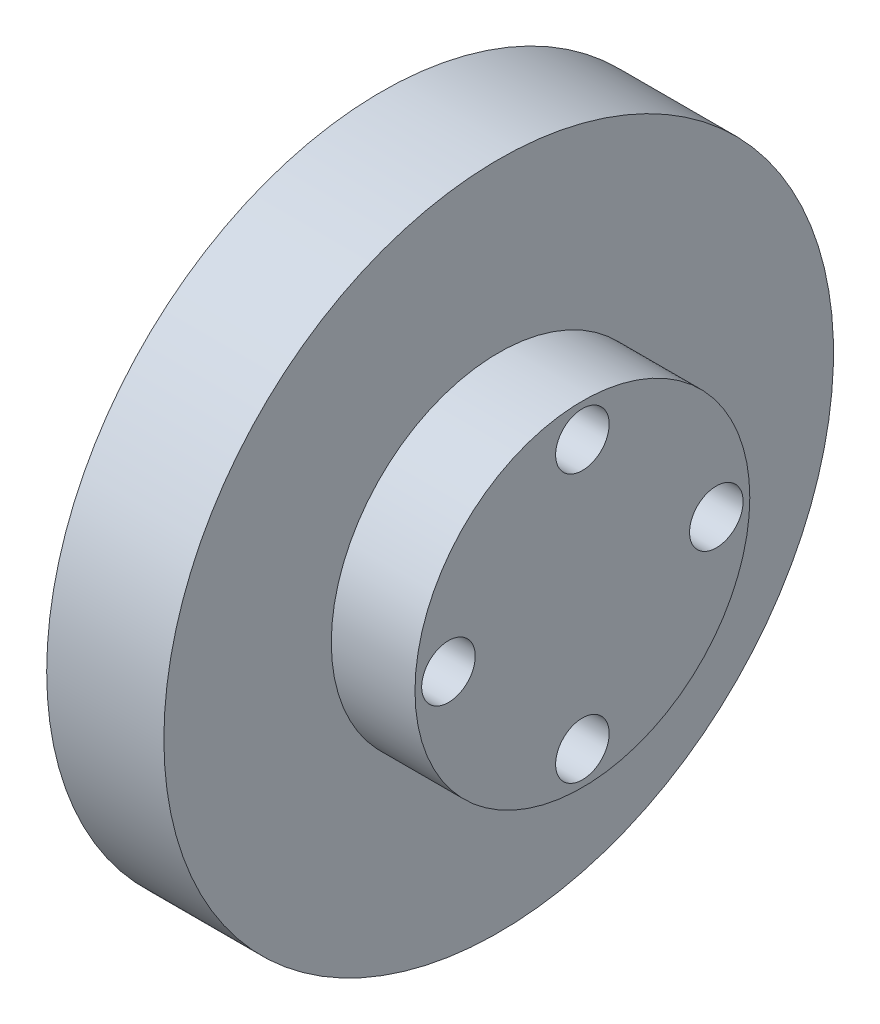
ISO-10303-21;
HEADER;
FILE_DESCRIPTION(('STEP AP214'),'2;1');
FILE_NAME('part.step','',(''),(''),'','','');
FILE_SCHEMA(('AUTOMOTIVE_DESIGN { 1 0 10303 214 1 1 1 1 }'));
ENDSEC;
DATA;
#1=APPLICATION_CONTEXT('core data for automotive mechanical design processes');
#2=APPLICATION_PROTOCOL_DEFINITION('international standard','automotive_design',2000,#1);
#3=PRODUCT_CONTEXT('',#1,'mechanical');
#4=PRODUCT('Part','Part','',(#3));
#5=PRODUCT_RELATED_PRODUCT_CATEGORY('part','',(#4));
#6=PRODUCT_DEFINITION_FORMATION('','',#4);
#7=PRODUCT_DEFINITION_CONTEXT('part definition',#1,'design');
#8=PRODUCT_DEFINITION('design','',#6,#7);
#9=PRODUCT_DEFINITION_SHAPE('','',#8);
#10=(LENGTH_UNIT() NAMED_UNIT(*) SI_UNIT(.MILLI.,.METRE.));
#11=(NAMED_UNIT(*) PLANE_ANGLE_UNIT() SI_UNIT($,.RADIAN.));
#12=(NAMED_UNIT(*) SI_UNIT($,.STERADIAN.) SOLID_ANGLE_UNIT());
#13=UNCERTAINTY_MEASURE_WITH_UNIT(LENGTH_MEASURE(1.E-05),#10,'distance_accuracy_value','');
#14=(GEOMETRIC_REPRESENTATION_CONTEXT(3) GLOBAL_UNCERTAINTY_ASSIGNED_CONTEXT((#13)) GLOBAL_UNIT_ASSIGNED_CONTEXT((#10,
#11,#12)) REPRESENTATION_CONTEXT('',''));
#15=CARTESIAN_POINT('',(0.,0.,0.));
#16=DIRECTION('',(0.,0.,1.));
#17=DIRECTION('',(1.,0.,0.));
#18=AXIS2_PLACEMENT_3D('',#15,#16,#17);
#19=CARTESIAN_POINT('',(10.,2.,0.));
#20=DIRECTION('',(1.,0.,0.));
#21=DIRECTION('',(0.,0.,-1.));
#22=AXIS2_PLACEMENT_3D('',#19,#20,#21);
#23=PLANE('',#22);
#24=CARTESIAN_POINT('',(10.,8.,0.));
#25=DIRECTION('',(1.,0.,0.));
#26=DIRECTION('',(0.,0.,-1.));
#27=AXIS2_PLACEMENT_3D('',#24,#25,#26);
#28=CIRCLE('',#27,1.6);
#29=CARTESIAN_POINT('',(10.,8.,-1.6));
#30=VERTEX_POINT('',#29);
#31=EDGE_CURVE('E55',#30,#30,#28,.T.);
#32=ORIENTED_EDGE('',*,*,#31,.T.);
#33=EDGE_LOOP('',(#32));
#34=FACE_BOUND('',#33,.T.);
#35=CARTESIAN_POINT('',(10.,0.,-8.));
#36=DIRECTION('',(1.,0.,0.));
#37=DIRECTION('',(0.,0.,-1.));
#38=AXIS2_PLACEMENT_3D('',#35,#36,#37);
#39=CIRCLE('',#38,1.6);
#40=CARTESIAN_POINT('',(10.,0.,-9.6));
#41=VERTEX_POINT('',#40);
#42=EDGE_CURVE('E58',#41,#41,#39,.T.);
#43=ORIENTED_EDGE('',*,*,#42,.T.);
#44=EDGE_LOOP('',(#43));
#45=FACE_BOUND('',#44,.T.);
#46=CARTESIAN_POINT('',(10.,-8.,0.));
#47=DIRECTION('',(1.,0.,0.));
#48=DIRECTION('',(0.,0.,-1.));
#49=AXIS2_PLACEMENT_3D('',#46,#47,#48);
#50=CIRCLE('',#49,1.6);
#51=CARTESIAN_POINT('',(10.,-8.,-1.6));
#52=VERTEX_POINT('',#51);
#53=EDGE_CURVE('E61',#52,#52,#50,.T.);
#54=ORIENTED_EDGE('',*,*,#53,.T.);
#55=EDGE_LOOP('',(#54));
#56=FACE_BOUND('',#55,.T.);
#57=CARTESIAN_POINT('',(10.,0.,8.));
#58=DIRECTION('',(1.,0.,0.));
#59=DIRECTION('',(0.,0.,-1.));
#60=AXIS2_PLACEMENT_3D('',#57,#58,#59);
#61=CIRCLE('',#60,1.6);
#62=CARTESIAN_POINT('',(10.,0.,6.4));
#63=VERTEX_POINT('',#62);
#64=EDGE_CURVE('E64',#63,#63,#61,.T.);
#65=ORIENTED_EDGE('',*,*,#64,.T.);
#66=EDGE_LOOP('',(#65));
#67=FACE_BOUND('',#66,.T.);
#68=CARTESIAN_POINT('',(10.,0.,0.));
#69=DIRECTION('',(-1.,0.,0.));
#70=DIRECTION('',(0.,0.,1.));
#71=AXIS2_PLACEMENT_3D('',#68,#69,#70);
#72=CIRCLE('',#71,20.);
#73=CARTESIAN_POINT('',(10.,0.,20.));
#74=VERTEX_POINT('',#73);
#75=EDGE_CURVE('E10',#74,#74,#72,.T.);
#76=ORIENTED_EDGE('',*,*,#75,.T.);
#77=EDGE_LOOP('',(#76));
#78=FACE_BOUND('',#77,.T.);
#79=ADVANCED_FACE('F36',(#34,#45,#56,#67,#78),#23,.F.);
#80=CARTESIAN_POINT('',(0.,0.,0.));
#81=DIRECTION('',(-1.,0.,0.));
#82=DIRECTION('',(0.,0.,1.));
#83=AXIS2_PLACEMENT_3D('',#80,#81,#82);
#84=CYLINDRICAL_SURFACE('',#83,20.);
#85=ORIENTED_EDGE('',*,*,#75,.F.);
#86=EDGE_LOOP('',(#85));
#87=FACE_BOUND('',#86,.T.);
#88=CARTESIAN_POINT('',(17.,0.,0.));
#89=DIRECTION('',(-1.,0.,0.));
#90=DIRECTION('',(0.,0.,1.));
#91=AXIS2_PLACEMENT_3D('',#88,#89,#90);
#92=CIRCLE('',#91,20.);
#93=CARTESIAN_POINT('',(17.,0.,20.));
#94=VERTEX_POINT('',#93);
#95=EDGE_CURVE('E42',#94,#94,#92,.T.);
#96=ORIENTED_EDGE('',*,*,#95,.T.);
#97=EDGE_LOOP('',(#96));
#98=FACE_BOUND('',#97,.T.);
#99=ADVANCED_FACE('F105',(#87,#98),#84,.T.);
#100=CARTESIAN_POINT('',(17.,20.,0.));
#101=DIRECTION('',(-1.,0.,0.));
#102=DIRECTION('',(0.,0.,1.));
#103=AXIS2_PLACEMENT_3D('',#100,#101,#102);
#104=PLANE('',#103);
#105=ORIENTED_EDGE('',*,*,#95,.F.);
#106=EDGE_LOOP('',(#105));
#107=FACE_BOUND('',#106,.T.);
#108=CARTESIAN_POINT('',(17.,0.,0.));
#109=DIRECTION('',(-1.,0.,0.));
#110=DIRECTION('',(0.,0.,1.));
#111=AXIS2_PLACEMENT_3D('',#108,#109,#110);
#112=CIRCLE('',#111,10.);
#113=CARTESIAN_POINT('',(17.,0.,10.));
#114=VERTEX_POINT('',#113);
#115=EDGE_CURVE('E46',#114,#114,#112,.T.);
#116=ORIENTED_EDGE('',*,*,#115,.T.);
#117=EDGE_LOOP('',(#116));
#118=FACE_BOUND('',#117,.T.);
#119=ADVANCED_FACE('F98',(#107,#118),#104,.F.);
#120=CARTESIAN_POINT('',(0.,0.,0.));
#121=DIRECTION('',(-1.,0.,0.));
#122=DIRECTION('',(0.,0.,1.));
#123=AXIS2_PLACEMENT_3D('',#120,#121,#122);
#124=CYLINDRICAL_SURFACE('',#123,10.);
#125=ORIENTED_EDGE('',*,*,#115,.F.);
#126=EDGE_LOOP('',(#125));
#127=FACE_BOUND('',#126,.T.);
#128=CARTESIAN_POINT('',(22.,0.,0.));
#129=DIRECTION('',(-1.,0.,0.));
#130=DIRECTION('',(0.,0.,1.));
#131=AXIS2_PLACEMENT_3D('',#128,#129,#130);
#132=CIRCLE('',#131,10.);
#133=CARTESIAN_POINT('',(22.,0.,10.));
#134=VERTEX_POINT('',#133);
#135=EDGE_CURVE('E50',#134,#134,#132,.T.);
#136=ORIENTED_EDGE('',*,*,#135,.T.);
#137=EDGE_LOOP('',(#136));
#138=FACE_BOUND('',#137,.T.);
#139=ADVANCED_FACE('F87',(#127,#138),#124,.T.);
#140=CARTESIAN_POINT('',(22.,10.,0.));
#141=DIRECTION('',(-1.,0.,0.));
#142=DIRECTION('',(0.,0.,1.));
#143=AXIS2_PLACEMENT_3D('',#140,#141,#142);
#144=PLANE('',#143);
#145=CARTESIAN_POINT('',(22.,8.,0.));
#146=DIRECTION('',(1.,0.,0.));
#147=DIRECTION('',(0.,0.,-1.));
#148=AXIS2_PLACEMENT_3D('',#145,#146,#147);
#149=CIRCLE('',#148,1.6);
#150=CARTESIAN_POINT('',(22.,8.,-1.6));
#151=VERTEX_POINT('',#150);
#152=EDGE_CURVE('E67',#151,#151,#149,.T.);
#153=ORIENTED_EDGE('',*,*,#152,.F.);
#154=EDGE_LOOP('',(#153));
#155=FACE_BOUND('',#154,.T.);
#156=CARTESIAN_POINT('',(22.,0.,-8.));
#157=DIRECTION('',(1.,0.,0.));
#158=DIRECTION('',(0.,0.,-1.));
#159=AXIS2_PLACEMENT_3D('',#156,#157,#158);
#160=CIRCLE('',#159,1.6);
#161=CARTESIAN_POINT('',(22.,0.,-9.6));
#162=VERTEX_POINT('',#161);
#163=EDGE_CURVE('E74',#162,#162,#160,.T.);
#164=ORIENTED_EDGE('',*,*,#163,.F.);
#165=EDGE_LOOP('',(#164));
#166=FACE_BOUND('',#165,.T.);
#167=CARTESIAN_POINT('',(22.,-8.,0.));
#168=DIRECTION('',(1.,0.,0.));
#169=DIRECTION('',(0.,0.,-1.));
#170=AXIS2_PLACEMENT_3D('',#167,#168,#169);
#171=CIRCLE('',#170,1.6);
#172=CARTESIAN_POINT('',(22.,-8.,-1.6));
#173=VERTEX_POINT('',#172);
#174=EDGE_CURVE('E71',#173,#173,#171,.T.);
#175=ORIENTED_EDGE('',*,*,#174,.F.);
#176=EDGE_LOOP('',(#175));
#177=FACE_BOUND('',#176,.T.);
#178=CARTESIAN_POINT('',(22.,0.,8.));
#179=DIRECTION('',(1.,0.,0.));
#180=DIRECTION('',(0.,0.,-1.));
#181=AXIS2_PLACEMENT_3D('',#178,#179,#180);
#182=CIRCLE('',#181,1.6);
#183=CARTESIAN_POINT('',(22.,0.,6.4));
#184=VERTEX_POINT('',#183);
#185=EDGE_CURVE('E68',#184,#184,#182,.T.);
#186=ORIENTED_EDGE('',*,*,#185,.F.);
#187=EDGE_LOOP('',(#186));
#188=FACE_BOUND('',#187,.T.);
#189=ORIENTED_EDGE('',*,*,#135,.F.);
#190=EDGE_LOOP('',(#189));
#191=FACE_BOUND('',#190,.T.);
#192=ADVANCED_FACE('F83',(#155,#166,#177,#188,#191),#144,.F.);
#193=CARTESIAN_POINT('',(-1.,0.,8.));
#194=DIRECTION('',(1.,0.,0.));
#195=DIRECTION('',(0.,0.,-1.));
#196=AXIS2_PLACEMENT_3D('',#193,#194,#195);
#197=CYLINDRICAL_SURFACE('',#196,1.6);
#198=ORIENTED_EDGE('',*,*,#185,.T.);
#199=EDGE_LOOP('',(#198));
#200=FACE_BOUND('',#199,.T.);
#201=ORIENTED_EDGE('',*,*,#64,.F.);
#202=EDGE_LOOP('',(#201));
#203=FACE_BOUND('',#202,.T.);
#204=ADVANCED_FACE('F86',(#200,#203),#197,.F.);
#205=CARTESIAN_POINT('',(-1.,-8.,0.));
#206=DIRECTION('',(1.,0.,0.));
#207=DIRECTION('',(0.,0.,-1.));
#208=AXIS2_PLACEMENT_3D('',#205,#206,#207);
#209=CYLINDRICAL_SURFACE('',#208,1.6);
#210=ORIENTED_EDGE('',*,*,#174,.T.);
#211=EDGE_LOOP('',(#210));
#212=FACE_BOUND('',#211,.T.);
#213=ORIENTED_EDGE('',*,*,#53,.F.);
#214=EDGE_LOOP('',(#213));
#215=FACE_BOUND('',#214,.T.);
#216=ADVANCED_FACE('F124',(#212,#215),#209,.F.);
#217=CARTESIAN_POINT('',(-1.,0.,-8.));
#218=DIRECTION('',(1.,0.,0.));
#219=DIRECTION('',(0.,0.,-1.));
#220=AXIS2_PLACEMENT_3D('',#217,#218,#219);
#221=CYLINDRICAL_SURFACE('',#220,1.6);
#222=ORIENTED_EDGE('',*,*,#163,.T.);
#223=EDGE_LOOP('',(#222));
#224=FACE_BOUND('',#223,.T.);
#225=ORIENTED_EDGE('',*,*,#42,.F.);
#226=EDGE_LOOP('',(#225));
#227=FACE_BOUND('',#226,.T.);
#228=ADVANCED_FACE('F130',(#224,#227),#221,.F.);
#229=CARTESIAN_POINT('',(-1.,8.,0.));
#230=DIRECTION('',(1.,0.,0.));
#231=DIRECTION('',(0.,0.,-1.));
#232=AXIS2_PLACEMENT_3D('',#229,#230,#231);
#233=CYLINDRICAL_SURFACE('',#232,1.6);
#234=ORIENTED_EDGE('',*,*,#152,.T.);
#235=EDGE_LOOP('',(#234));
#236=FACE_BOUND('',#235,.T.);
#237=ORIENTED_EDGE('',*,*,#31,.F.);
#238=EDGE_LOOP('',(#237));
#239=FACE_BOUND('',#238,.T.);
#240=ADVANCED_FACE('F80',(#236,#239),#233,.F.);
#241=CLOSED_SHELL('',(#79,#99,#119,#139,#192,#204,#216,#228,#240));
#242=MANIFOLD_SOLID_BREP('B2',#241);
#243=ADVANCED_BREP_SHAPE_REPRESENTATION('',(#18,#242),#14);
#244=SHAPE_DEFINITION_REPRESENTATION(#9,#243);
ENDSEC;
END-ISO-10303-21;
